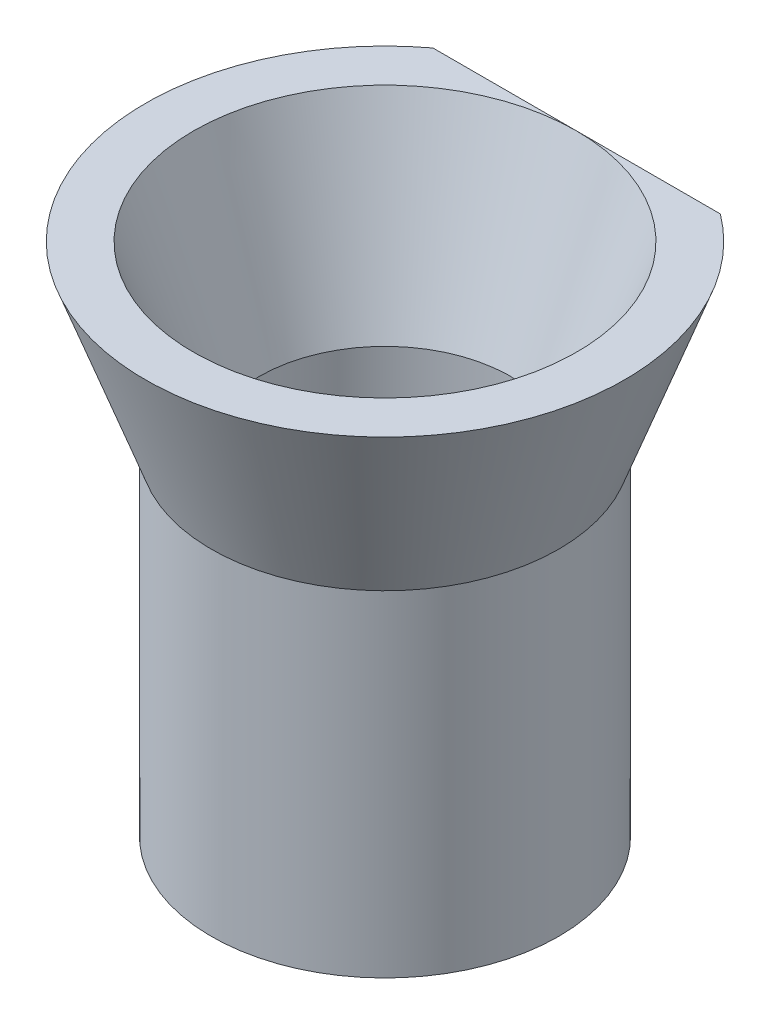
ISO-10303-21;
HEADER;
FILE_DESCRIPTION(('STEP AP214'),'2;1');
FILE_NAME('part.step','',(''),(''),'','','');
FILE_SCHEMA(('AUTOMOTIVE_DESIGN { 1 0 10303 214 1 1 1 1 }'));
ENDSEC;
DATA;
#1=APPLICATION_CONTEXT('core data for automotive mechanical design processes');
#2=APPLICATION_PROTOCOL_DEFINITION('international standard','automotive_design',2000,#1);
#3=PRODUCT_CONTEXT('',#1,'mechanical');
#4=PRODUCT('Part','Part','',(#3));
#5=PRODUCT_RELATED_PRODUCT_CATEGORY('part','',(#4));
#6=PRODUCT_DEFINITION_FORMATION('','',#4);
#7=PRODUCT_DEFINITION_CONTEXT('part definition',#1,'design');
#8=PRODUCT_DEFINITION('design','',#6,#7);
#9=PRODUCT_DEFINITION_SHAPE('','',#8);
#10=(LENGTH_UNIT() NAMED_UNIT(*) SI_UNIT(.MILLI.,.METRE.));
#11=(NAMED_UNIT(*) PLANE_ANGLE_UNIT() SI_UNIT($,.RADIAN.));
#12=(NAMED_UNIT(*) SI_UNIT($,.STERADIAN.) SOLID_ANGLE_UNIT());
#13=UNCERTAINTY_MEASURE_WITH_UNIT(LENGTH_MEASURE(1.E-05),#10,'distance_accuracy_value','');
#14=(GEOMETRIC_REPRESENTATION_CONTEXT(3) GLOBAL_UNCERTAINTY_ASSIGNED_CONTEXT((#13)) GLOBAL_UNIT_ASSIGNED_CONTEXT((#10,
#11,#12)) REPRESENTATION_CONTEXT('',''));
#15=CARTESIAN_POINT('',(0.,0.,0.));
#16=DIRECTION('',(0.,0.,1.));
#17=DIRECTION('',(1.,0.,0.));
#18=AXIS2_PLACEMENT_3D('',#15,#16,#17);
#19=CARTESIAN_POINT('',(0.,7.5,0.));
#20=DIRECTION('',(0.,1.,0.));
#21=DIRECTION('',(-1.,0.,0.));
#22=AXIS2_PLACEMENT_3D('',#19,#20,#21);
#23=CONICAL_SURFACE('',#22,10.,0.351444794003552);
#24=CARTESIAN_POINT('',(-21.1102159869829,41.7960944706743,-8.));
#25=CARTESIAN_POINT('',(-20.8575922601672,41.1518374013354,-8.));
#26=CARTESIAN_POINT('',(-20.6044793679952,40.5077722083937,-8.));
#27=CARTESIAN_POINT('',(-20.0971527548782,39.2200746485511,-8.));
#28=CARTESIAN_POINT('',(-19.8429390325741,38.5764422821857,-8.));
#29=CARTESIAN_POINT('',(-19.0784336900916,36.6461943704329,-8.));
#30=CARTESIAN_POINT('',(-18.5663077255766,35.3603041753729,-8.));
#31=CARTESIAN_POINT('',(-17.5346227725087,32.7879247378318,-8.));
#32=CARTESIAN_POINT('',(-17.0150488966548,31.5014414619999,-8.));
#33=CARTESIAN_POINT('',(-15.9678551504561,28.9318109594217,-8.));
#34=CARTESIAN_POINT('',(-15.4402356335751,27.6486635890037,-8.));
#35=CARTESIAN_POINT('',(-14.6351332892816,25.7139548351362,-8.));
#36=CARTESIAN_POINT('',(-14.3616494433898,25.0607292172748,-8.));
#37=CARTESIAN_POINT('',(-13.8113508588351,23.7556826348974,-8.));
#38=CARTESIAN_POINT('',(-13.534536126545,23.1038616676966,-8.));
#39=CARTESIAN_POINT('',(-12.9769148559497,21.8018203202888,-8.));
#40=CARTESIAN_POINT('',(-12.6961077670536,21.1516001756479,-8.));
#41=CARTESIAN_POINT('',(-12.1297365635867,19.8532371536935,-8.));
#42=CARTESIAN_POINT('',(-11.8441724780189,19.205094263744,-8.));
#43=CARTESIAN_POINT('',(-11.2675578686279,17.9121163462788,-8.));
#44=CARTESIAN_POINT('',(-10.9765138283763,17.2672784328882,-8.));
#45=CARTESIAN_POINT('',(-10.3872290263202,15.9809048026418,-8.));
#46=CARTESIAN_POINT('',(-10.0889883633972,15.3393690405613,-8.));
#47=CARTESIAN_POINT('',(-9.48345103519993,14.0607379824334,-8.));
#48=CARTESIAN_POINT('',(-9.17615638821536,13.4236417353146,-8.));
#49=CARTESIAN_POINT('',(-8.70629315719258,12.4724268115119,-8.));
#50=CARTESIAN_POINT('',(-8.54818940532329,12.1561015304171,-8.));
#51=CARTESIAN_POINT('',(-8.22852698580347,11.5252030607291,-8.));
#52=CARTESIAN_POINT('',(-8.06696836725552,11.2106298473144,-8.));
#53=CARTESIAN_POINT('',(-7.78823733400516,10.6763831491525,-8.));
#54=CARTESIAN_POINT('',(-7.67208090196868,10.4561795286999,-8.));
#55=CARTESIAN_POINT('',(-7.4375231342389,10.0169663968996,-8.));
#56=CARTESIAN_POINT('',(-7.31912177253687,9.79795689942424,-8.));
#57=CARTESIAN_POINT('',(-7.07976133270324,9.36127399541248,-8.));
#58=CARTESIAN_POINT('',(-6.95880168136888,9.14360090271009,-8.));
#59=CARTESIAN_POINT('',(-6.71400702135635,8.70987678746253,-8.));
#60=CARTESIAN_POINT('',(-6.59017202810923,8.4938257562205,-8.));
#61=CARTESIAN_POINT('',(-6.3390809368741,8.06341655860036,-8.));
#62=CARTESIAN_POINT('',(-6.21182141754747,7.84906038467442,-8.));
#63=CARTESIAN_POINT('',(-5.95350024106409,7.42265270333729,-8.));
#64=CARTESIAN_POINT('',(-5.82243866286389,7.2106011481921,-8.));
#65=CARTESIAN_POINT('',(-5.55592707516957,6.78935919939185,-8.));
#66=CARTESIAN_POINT('',(-5.42047845495659,6.58016792922101,-8.));
#67=CARTESIAN_POINT('',(-5.14438169250434,6.16525523865421,-8.));
#68=CARTESIAN_POINT('',(-5.00373389275148,5.95953359099869,-8.));
#69=CARTESIAN_POINT('',(-4.70026101351693,5.52980731817096,-8.));
#70=CARTESIAN_POINT('',(-4.53670889478824,5.30631316982506,-8.));
#71=CARTESIAN_POINT('',(-4.20013234484751,4.866376313959,-8.));
#72=CARTESIAN_POINT('',(-4.02710409616744,4.6499365051325,-8.));
#73=CARTESIAN_POINT('',(-3.66987246573023,4.22759912847203,-8.));
#74=CARTESIAN_POINT('',(-3.48570722317699,4.02166959013735,-8.));
#75=CARTESIAN_POINT('',(-3.10277654429937,3.62400357030217,-8.));
#76=CARTESIAN_POINT('',(-2.90402605512787,3.43225295183798,-8.));
#77=CARTESIAN_POINT('',(-2.51586106087971,3.0941925159353,-8.));
#78=CARTESIAN_POINT('',(-2.32878306239676,2.94523927611635,-8.));
#79=CARTESIAN_POINT('',(-1.93793080476183,2.67057482394348,-8.));
#80=CARTESIAN_POINT('',(-1.73416332412817,2.54485424242353,-8.));
#81=CARTESIAN_POINT('',(-1.34780069778661,2.34808044027966,-8.));
#82=CARTESIAN_POINT('',(-1.16826286382033,2.2712165069629,-8.));
#83=CARTESIAN_POINT('',(-0.891433133934699,2.17906473079299,-8.));
#84=CARTESIAN_POINT('',(-0.797950786499843,2.15221238958167,-8.));
#85=CARTESIAN_POINT('',(-0.608960145095878,2.10707058334681,-8.));
#86=CARTESIAN_POINT('',(-0.513452928754523,2.08877667747967,-8.));
#87=CARTESIAN_POINT('',(-0.320118826505181,2.06131168051508,-8.));
#88=CARTESIAN_POINT('',(-0.22227817912978,2.0522365284554,-8.));
#89=CARTESIAN_POINT('',(-0.0261783799995768,2.04393338126089,-8.));
#90=CARTESIAN_POINT('',(0.0720807565514693,2.04470503139036,-8.));
#91=CARTESIAN_POINT('',(0.268086037207818,2.05606488264282,-8.));
#92=CARTESIAN_POINT('',(0.365831820185232,2.06665925159914,-8.));
#93=CARTESIAN_POINT('',(0.55988394920774,2.09722430426101,-8.));
#94=CARTESIAN_POINT('',(0.65618944039015,2.11720034487825,-8.));
#95=CARTESIAN_POINT('',(0.85622895731809,2.16821705386969,-8.));
#96=CARTESIAN_POINT('',(0.959728570582942,2.2001728053813,-8.));
#97=CARTESIAN_POINT('',(1.16346480563838,2.27325994427766,-8.));
#98=CARTESIAN_POINT('',(1.2636990563535,2.31439783608479,-8.));
#99=CARTESIAN_POINT('',(1.5591317744341,2.44963659721537,-8.));
#100=CARTESIAN_POINT('',(1.74896027096179,2.55553477439048,-8.));
#101=CARTESIAN_POINT('',(2.09714948435566,2.77837828445182,-8.));
#102=CARTESIAN_POINT('',(2.25679627437119,2.89339169079169,-8.));
#103=CARTESIAN_POINT('',(2.56583601363868,3.13662962555286,-8.));
#104=CARTESIAN_POINT('',(2.71521930625599,3.26486631926459,-8.));
#105=CARTESIAN_POINT('',(3.00555506339771,3.53143272683563,-8.));
#106=CARTESIAN_POINT('',(3.14647577444905,3.66979659813975,-8.));
#107=CARTESIAN_POINT('',(3.42065947426139,3.9537380758329,-8.));
#108=CARTESIAN_POINT('',(3.55392602127944,4.09931227070952,-8.));
#109=CARTESIAN_POINT('',(3.80897780091378,4.39026671931957,-8.));
#110=CARTESIAN_POINT('',(3.93100806925893,4.53543349790041,-8.));
#111=CARTESIAN_POINT('',(4.17001224828792,4.82988221893735,-8.));
#112=CARTESIAN_POINT('',(4.28698553060407,4.97916466904312,-8.));
#113=CARTESIAN_POINT('',(4.63153615834912,5.43211727195964,-8.));
#114=CARTESIAN_POINT('',(4.85260907956436,5.74073461882981,-8.));
#115=CARTESIAN_POINT('',(5.28210728017788,6.36755539634882,-8.));
#116=CARTESIAN_POINT('',(5.49050276687715,6.68577896318135,-8.));
#117=CARTESIAN_POINT('',(5.89706207242371,7.3287251440575,-8.));
#118=CARTESIAN_POINT('',(6.09522461103868,7.65344856427232,-8.));
#119=CARTESIAN_POINT('',(6.48513389072705,8.31067292357395,-8.));
#120=CARTESIAN_POINT('',(6.67680650287343,8.64321762228747,-8.));
#121=CARTESIAN_POINT('',(7.05341997412407,9.31211526327614,-8.));
#122=CARTESIAN_POINT('',(7.2383603750799,9.64846846269739,-8.));
#123=CARTESIAN_POINT('',(7.60238863881815,10.3236310458419,-8.));
#124=CARTESIAN_POINT('',(7.78148532108801,10.6624356862823,-8.));
#125=CARTESIAN_POINT('',(8.1350230512864,11.3424462779885,-8.));
#126=CARTESIAN_POINT('',(8.30946424530655,11.6836521534767,-8.));
#127=CARTESIAN_POINT('',(8.80491316916672,12.6665966230278,-8.));
#128=CARTESIAN_POINT('',(9.12100897881907,13.3108109367124,-8.));
#129=CARTESIAN_POINT('',(9.74286003379007,14.604221799152,-8.));
#130=CARTESIAN_POINT('',(10.0486147714302,15.2534185905996,-8.));
#131=CARTESIAN_POINT('',(10.6521002759884,16.5556510726279,-8.));
#132=CARTESIAN_POINT('',(10.9498297422005,17.2086873648552,-8.));
#133=CARTESIAN_POINT('',(11.5388597836566,18.5176543575978,-8.));
#134=CARTESIAN_POINT('',(11.8301602955395,19.173585086563,-8.));
#135=CARTESIAN_POINT('',(12.4079403831016,20.4886574254161,-8.));
#136=CARTESIAN_POINT('',(12.6944126497742,21.1478022421663,-8.));
#137=CARTESIAN_POINT('',(13.2630359966841,22.4679540829824,-8.));
#138=CARTESIAN_POINT('',(13.5451870596352,23.1289611144851,-8.));
#139=CARTESIAN_POINT('',(14.1058476175721,24.4524390746586,-8.));
#140=CARTESIAN_POINT('',(14.384357471296,25.1149098514854,-8.));
#141=CARTESIAN_POINT('',(14.9383177555662,26.44112991698,-8.));
#142=CARTESIAN_POINT('',(15.2137681794432,27.104879208431,-8.));
#143=CARTESIAN_POINT('',(15.9995462813487,29.0088864613718,-8.));
#144=CARTESIAN_POINT('',(16.5066427390412,30.2504780290056,-8.));
#145=CARTESIAN_POINT('',(17.5139488579621,32.7364887151155,-8.));
#146=CARTESIAN_POINT('',(18.0141583138949,33.9809079165983,-8.));
#147=CARTESIAN_POINT('',(19.0080295912064,36.4690603332438,-8.));
#148=CARTESIAN_POINT('',(19.5017037623694,37.7127886183221,-8.));
#149=CARTESIAN_POINT('',(20.2389735529234,39.5796299177238,-8.));
#150=CARTESIAN_POINT('',(20.4841849148688,40.2021057304535,-8.));
#151=CARTESIAN_POINT('',(20.973632913784,41.4474397983232,-8.));
#152=CARTESIAN_POINT('',(21.217869551676,42.0702980531007,-8.));
#153=CARTESIAN_POINT('',(21.4616702189961,42.6933269619794,-8.));
#154=B_SPLINE_CURVE_WITH_KNOTS('',3,(#24,#25,#26,#27,#28,#29,#30,#31,#32,#33,#34,#35,#36,#37,
#38,#39,#40,#41,#42,#43,#44,#45,#46,#47,#48,#49,#50,#51,#52,#53,#54,#55,#56,#57,#58,#59,#60,#61,
#62,#63,#64,#65,#66,#67,#68,#69,#70,#71,#72,#73,#74,#75,#76,#77,#78,#79,#80,#81,#82,#83,#84,#85,
#86,#87,#88,#89,#90,#91,#92,#93,#94,#95,#96,#97,#98,#99,#100,#101,#102,#103,#104,#105,#106,#107,
#108,#109,#110,#111,#112,#113,#114,#115,#116,#117,#118,#119,#120,#121,#122,#123,#124,#125,#126,
#127,#128,#129,#130,#131,#132,#133,#134,#135,#136,#137,#138,#139,#140,#141,#142,#143,#144,#145,
#146,#147,#148,#149,#150,#151,#152,#153),.UNSPECIFIED.,.F.,.F.,(4,2,2,2,2,2,2,2,2,2,2,2,2,2,2,2,
2,2,2,2,2,2,2,2,2,2,2,2,2,2,2,2,2,2,2,2,2,2,2,2,2,2,2,2,2,2,2,2,2,2,2,2,2,2,2,2,2,2,2,2,2,2,2,2,
4),(0.,2.07604706332852,4.15209669031076,8.30444133305793,12.4667498410135,16.6288760128321,
18.7533626342895,20.8778451916952,23.0026236373029,25.1273891331006,27.2497816388602,
29.3721449995419,31.4940387757919,32.5549308221936,33.615807800588,34.3626821851255,
35.109565227903,35.8566174260442,36.6036656159218,37.3514901053443,38.099299075956,
38.8468735035932,39.5943987735868,40.4250408315579,41.2560200117774,42.0842990224122,
42.9117407470898,43.6279525129034,44.3438748146001,44.9273481674755,45.2187968893933,
45.5100942147522,45.8043929219836,46.0986810269952,46.3931540451849,46.687795411562,
47.0122513887002,47.3369379367523,47.9866183092652,48.5761190305273,49.1661670087826,
49.7583060159533,50.3501674844225,50.9189664891421,51.4878359693623,52.626197863595,
53.7671391180089,54.908222770146,56.0596145087486,57.2110844573006,58.3607276146685,
59.5103346531181,61.6629503311944,63.8156715355714,65.9687395721922,68.1218288190856,
70.2779280919714,72.4340359876591,74.5899298343667,76.7458283797541,80.769262087195,
84.7928154710962,88.807174898191,90.8142723730148,92.8213679482329),.UNSPECIFIED.);
#155=CARTESIAN_POINT('',(6.,7.5,-8.));
#156=VERTEX_POINT('',#155);
#157=CARTESIAN_POINT('',(-6.,7.5,-8.));
#158=VERTEX_POINT('',#157);
#159=EDGE_CURVE('E51',#156,#158,#154,.F.);
#160=ORIENTED_EDGE('',*,*,#159,.F.);
#161=CARTESIAN_POINT('',(0.,7.5,0.));
#162=DIRECTION('',(0.,1.,0.));
#163=DIRECTION('',(-1.,0.,0.));
#164=AXIS2_PLACEMENT_3D('',#161,#162,#163);
#165=CIRCLE('',#164,10.);
#166=EDGE_CURVE('E61',#158,#156,#165,.T.);
#167=ORIENTED_EDGE('',*,*,#166,.F.);
#168=EDGE_LOOP('',(#160,#167));
#169=FACE_BOUND('',#168,.T.);
#170=CARTESIAN_POINT('',(0.,0.,0.));
#171=DIRECTION('',(0.,-1.,0.));
#172=DIRECTION('',(1.,0.,0.));
#173=AXIS2_PLACEMENT_3D('',#170,#171,#172);
#174=CIRCLE('',#173,7.25);
#175=CARTESIAN_POINT('',(7.25,0.,0.));
#176=VERTEX_POINT('',#175);
#177=EDGE_CURVE('E70',#176,#176,#174,.T.);
#178=ORIENTED_EDGE('',*,*,#177,.F.);
#179=EDGE_LOOP('',(#178));
#180=FACE_BOUND('',#179,.T.);
#181=ADVANCED_FACE('F33',(#169,#180),#23,.T.);
#182=CARTESIAN_POINT('',(0.,0.,0.));
#183=DIRECTION('',(0.,1.,0.));
#184=DIRECTION('',(-1.,0.,0.));
#185=AXIS2_PLACEMENT_3D('',#182,#183,#184);
#186=CONICAL_SURFACE('',#185,5.25,0.351444794003552);
#187=CARTESIAN_POINT('',(0.,7.5,0.));
#188=DIRECTION('',(0.,1.,0.));
#189=DIRECTION('',(-1.,0.,0.));
#190=AXIS2_PLACEMENT_3D('',#187,#188,#189);
#191=CIRCLE('',#190,8.);
#192=CARTESIAN_POINT('',(0.,7.5,-8.));
#193=VERTEX_POINT('',#192);
#194=EDGE_CURVE('E63',#193,#193,#191,.T.);
#195=ORIENTED_EDGE('',*,*,#194,.T.);
#196=EDGE_LOOP('',(#195));
#197=FACE_BOUND('',#196,.T.);
#198=CARTESIAN_POINT('',(0.,0.,0.));
#199=DIRECTION('',(0.,1.,0.));
#200=DIRECTION('',(-1.,0.,0.));
#201=AXIS2_PLACEMENT_3D('',#198,#199,#200);
#202=CIRCLE('',#201,5.25);
#203=CARTESIAN_POINT('',(-5.25,0.,0.));
#204=VERTEX_POINT('',#203);
#205=EDGE_CURVE('E67',#204,#204,#202,.T.);
#206=ORIENTED_EDGE('',*,*,#205,.F.);
#207=EDGE_LOOP('',(#206));
#208=FACE_BOUND('',#207,.T.);
#209=ADVANCED_FACE('F78',(#197,#208),#186,.F.);
#210=CARTESIAN_POINT('',(-8.,7.5,0.));
#211=DIRECTION('',(0.,1.,0.));
#212=DIRECTION('',(-1.,0.,0.));
#213=AXIS2_PLACEMENT_3D('',#210,#211,#212);
#214=PLANE('',#213);
#215=DIRECTION('',(1.,0.,0.));
#216=VECTOR('',#215,1.);
#217=CARTESIAN_POINT('',(-8.,7.5,-8.));
#218=LINE('',#217,#216);
#219=EDGE_CURVE('E11',#158,#193,#218,.T.);
#220=ORIENTED_EDGE('',*,*,#219,.F.);
#221=ORIENTED_EDGE('',*,*,#166,.T.);
#222=EDGE_CURVE('E37',#193,#156,#218,.T.);
#223=ORIENTED_EDGE('',*,*,#222,.F.);
#224=ORIENTED_EDGE('',*,*,#194,.F.);
#225=EDGE_LOOP('',(#220,#221,#223,#224));
#226=FACE_BOUND('',#225,.T.);
#227=ADVANCED_FACE('F60',(#226),#214,.T.);
#228=CARTESIAN_POINT('',(0.,-14.,0.));
#229=DIRECTION('',(0.,-1.,0.));
#230=DIRECTION('',(1.,0.,0.));
#231=AXIS2_PLACEMENT_3D('',#228,#229,#230);
#232=PLANE('',#231);
#233=CARTESIAN_POINT('',(0.,-14.,0.));
#234=DIRECTION('',(0.,-1.,0.));
#235=DIRECTION('',(1.,0.,0.));
#236=AXIS2_PLACEMENT_3D('',#233,#234,#235);
#237=CIRCLE('',#236,7.25);
#238=CARTESIAN_POINT('',(7.25,-14.,0.));
#239=VERTEX_POINT('',#238);
#240=EDGE_CURVE('E65',#239,#239,#237,.T.);
#241=ORIENTED_EDGE('',*,*,#240,.T.);
#242=EDGE_LOOP('',(#241));
#243=FACE_BOUND('',#242,.T.);
#244=CARTESIAN_POINT('',(0.,-14.,0.));
#245=DIRECTION('',(0.,-1.,0.));
#246=DIRECTION('',(1.,0.,0.));
#247=AXIS2_PLACEMENT_3D('',#244,#245,#246);
#248=CIRCLE('',#247,5.25);
#249=CARTESIAN_POINT('',(5.25,-14.,0.));
#250=VERTEX_POINT('',#249);
#251=EDGE_CURVE('E56',#250,#250,#248,.T.);
#252=ORIENTED_EDGE('',*,*,#251,.F.);
#253=EDGE_LOOP('',(#252));
#254=FACE_BOUND('',#253,.T.);
#255=ADVANCED_FACE('F85',(#243,#254),#232,.T.);
#256=CARTESIAN_POINT('',(0.,-14.,0.));
#257=DIRECTION('',(0.,1.,0.));
#258=DIRECTION('',(-1.,0.,0.));
#259=AXIS2_PLACEMENT_3D('',#256,#257,#258);
#260=CYLINDRICAL_SURFACE('',#259,7.25);
#261=ORIENTED_EDGE('',*,*,#240,.F.);
#262=EDGE_LOOP('',(#261));
#263=FACE_BOUND('',#262,.T.);
#264=ORIENTED_EDGE('',*,*,#177,.T.);
#265=EDGE_LOOP('',(#264));
#266=FACE_BOUND('',#265,.T.);
#267=ADVANCED_FACE('F88',(#263,#266),#260,.T.);
#268=CARTESIAN_POINT('',(0.,-14.,0.));
#269=DIRECTION('',(0.,1.,0.));
#270=DIRECTION('',(-1.,0.,0.));
#271=AXIS2_PLACEMENT_3D('',#268,#269,#270);
#272=CYLINDRICAL_SURFACE('',#271,5.25);
#273=ORIENTED_EDGE('',*,*,#251,.T.);
#274=EDGE_LOOP('',(#273));
#275=FACE_BOUND('',#274,.T.);
#276=ORIENTED_EDGE('',*,*,#205,.T.);
#277=EDGE_LOOP('',(#276));
#278=FACE_BOUND('',#277,.T.);
#279=ADVANCED_FACE('F76',(#275,#278),#272,.F.);
#280=CARTESIAN_POINT('',(-7.47980791742834,-2.5,-8.));
#281=DIRECTION('',(0.,0.,1.));
#282=DIRECTION('',(1.,0.,0.));
#283=AXIS2_PLACEMENT_3D('',#280,#281,#282);
#284=PLANE('',#283);
#285=ORIENTED_EDGE('',*,*,#159,.T.);
#286=ORIENTED_EDGE('',*,*,#219,.T.);
#287=ORIENTED_EDGE('',*,*,#222,.T.);
#288=EDGE_LOOP('',(#285,#286,#287));
#289=FACE_BOUND('',#288,.T.);
#290=ADVANCED_FACE('F52',(#289),#284,.F.);
#291=CLOSED_SHELL('',(#181,#209,#227,#255,#267,#279,#290));
#292=MANIFOLD_SOLID_BREP('B2',#291);
#293=ADVANCED_BREP_SHAPE_REPRESENTATION('',(#18,#292),#14);
#294=SHAPE_DEFINITION_REPRESENTATION(#9,#293);
ENDSEC;
END-ISO-10303-21;
